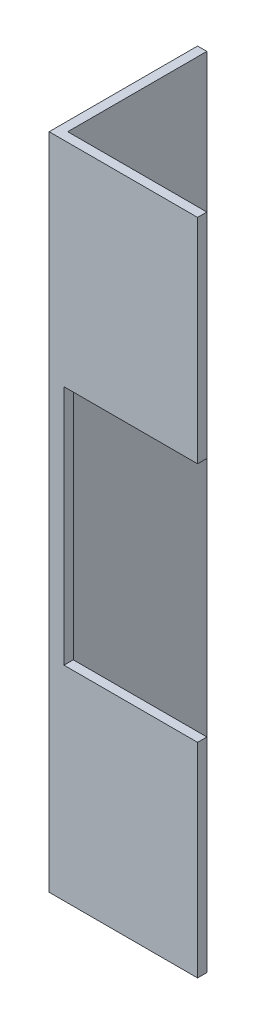
ISO-10303-21;
HEADER;
FILE_DESCRIPTION(('STEP AP214'),'2;1');
FILE_NAME('part.step','',(''),(''),'','','');
FILE_SCHEMA(('AUTOMOTIVE_DESIGN { 1 0 10303 214 1 1 1 1 }'));
ENDSEC;
DATA;
#1=APPLICATION_CONTEXT('core data for automotive mechanical design processes');
#2=APPLICATION_PROTOCOL_DEFINITION('international standard','automotive_design',2000,#1);
#3=PRODUCT_CONTEXT('',#1,'mechanical');
#4=PRODUCT('Part','Part','',(#3));
#5=PRODUCT_RELATED_PRODUCT_CATEGORY('part','',(#4));
#6=PRODUCT_DEFINITION_FORMATION('','',#4);
#7=PRODUCT_DEFINITION_CONTEXT('part definition',#1,'design');
#8=PRODUCT_DEFINITION('design','',#6,#7);
#9=PRODUCT_DEFINITION_SHAPE('','',#8);
#10=(LENGTH_UNIT() NAMED_UNIT(*) SI_UNIT(.MILLI.,.METRE.));
#11=(NAMED_UNIT(*) PLANE_ANGLE_UNIT() SI_UNIT($,.RADIAN.));
#12=(NAMED_UNIT(*) SI_UNIT($,.STERADIAN.) SOLID_ANGLE_UNIT());
#13=UNCERTAINTY_MEASURE_WITH_UNIT(LENGTH_MEASURE(1.E-05),#10,'distance_accuracy_value','');
#14=(GEOMETRIC_REPRESENTATION_CONTEXT(3) GLOBAL_UNCERTAINTY_ASSIGNED_CONTEXT((#13)) GLOBAL_UNIT_ASSIGNED_CONTEXT((#10,
#11,#12)) REPRESENTATION_CONTEXT('',''));
#15=CARTESIAN_POINT('',(0.,0.,0.));
#16=DIRECTION('',(0.,0.,1.));
#17=DIRECTION('',(1.,0.,0.));
#18=AXIS2_PLACEMENT_3D('',#15,#16,#17);
#19=CARTESIAN_POINT('',(25.4,112.7125,-1.5875));
#20=DIRECTION('',(-1.,0.,0.));
#21=DIRECTION('',(0.,0.,1.));
#22=AXIS2_PLACEMENT_3D('',#19,#20,#21);
#23=PLANE('',#22);
#24=DIRECTION('',(0.,-1.,0.));
#25=VECTOR('',#24,1.);
#26=CARTESIAN_POINT('',(25.4,112.7125,0.));
#27=LINE('',#26,#25);
#28=CARTESIAN_POINT('',(25.4,112.7125,0.));
#29=VERTEX_POINT('',#28);
#30=CARTESIAN_POINT('',(25.4,76.2,0.));
#31=VERTEX_POINT('',#30);
#32=EDGE_CURVE('E11',#29,#31,#27,.T.);
#33=ORIENTED_EDGE('',*,*,#32,.T.);
#34=DIRECTION('',(0.,0.,-1.));
#35=VECTOR('',#34,1.);
#36=CARTESIAN_POINT('',(25.4,76.2,0.));
#37=LINE('',#36,#35);
#38=CARTESIAN_POINT('',(25.4,76.2,-1.5875));
#39=VERTEX_POINT('',#38);
#40=EDGE_CURVE('E136',#31,#39,#37,.T.);
#41=ORIENTED_EDGE('',*,*,#40,.T.);
#42=DIRECTION('',(0.,-1.,0.));
#43=VECTOR('',#42,1.);
#44=CARTESIAN_POINT('',(25.4,112.7125,-1.5875));
#45=LINE('',#44,#43);
#46=CARTESIAN_POINT('',(25.4,112.7125,-1.5875));
#47=VERTEX_POINT('',#46);
#48=EDGE_CURVE('E149',#47,#39,#45,.T.);
#49=ORIENTED_EDGE('',*,*,#48,.F.);
#50=DIRECTION('',(0.,0.,-1.));
#51=VECTOR('',#50,1.);
#52=CARTESIAN_POINT('',(25.4,112.7125,-1.5875));
#53=LINE('',#52,#51);
#54=EDGE_CURVE('E94',#29,#47,#53,.T.);
#55=ORIENTED_EDGE('',*,*,#54,.F.);
#56=EDGE_LOOP('',(#33,#41,#49,#55));
#57=FACE_BOUND('',#56,.T.);
#58=ADVANCED_FACE('F35',(#57),#23,.F.);
#59=CARTESIAN_POINT('',(25.4,112.7125,0.));
#60=DIRECTION('',(0.,0.,-1.));
#61=DIRECTION('',(-1.,0.,0.));
#62=AXIS2_PLACEMENT_3D('',#59,#60,#61);
#63=PLANE('',#62);
#64=DIRECTION('',(0.,1.,0.));
#65=VECTOR('',#64,1.);
#66=CARTESIAN_POINT('',(2.54,34.925,0.));
#67=LINE('',#66,#65);
#68=CARTESIAN_POINT('',(2.54,34.925,0.));
#69=VERTEX_POINT('',#68);
#70=CARTESIAN_POINT('',(2.54,76.2,0.));
#71=VERTEX_POINT('',#70);
#72=EDGE_CURVE('E193',#69,#71,#67,.T.);
#73=ORIENTED_EDGE('',*,*,#72,.T.);
#74=DIRECTION('',(1.,0.,0.));
#75=VECTOR('',#74,1.);
#76=CARTESIAN_POINT('',(25.4,76.2,0.));
#77=LINE('',#76,#75);
#78=EDGE_CURVE('E176',#71,#31,#77,.T.);
#79=ORIENTED_EDGE('',*,*,#78,.T.);
#80=ORIENTED_EDGE('',*,*,#32,.F.);
#81=DIRECTION('',(1.,0.,0.));
#82=VECTOR('',#81,1.);
#83=CARTESIAN_POINT('',(25.4,112.7125,0.));
#84=LINE('',#83,#82);
#85=CARTESIAN_POINT('',(0.,112.7125,0.));
#86=VERTEX_POINT('',#85);
#87=EDGE_CURVE('E145',#86,#29,#84,.T.);
#88=ORIENTED_EDGE('',*,*,#87,.F.);
#89=DIRECTION('',(0.,-1.,0.));
#90=VECTOR('',#89,1.);
#91=CARTESIAN_POINT('',(0.,112.7125,0.));
#92=LINE('',#91,#90);
#93=CARTESIAN_POINT('',(0.,0.,0.));
#94=VERTEX_POINT('',#93);
#95=EDGE_CURVE('E128',#86,#94,#92,.T.);
#96=ORIENTED_EDGE('',*,*,#95,.T.);
#97=DIRECTION('',(1.,0.,0.));
#98=VECTOR('',#97,1.);
#99=CARTESIAN_POINT('',(25.4,0.,0.));
#100=LINE('',#99,#98);
#101=CARTESIAN_POINT('',(25.4,0.,0.));
#102=VERTEX_POINT('',#101);
#103=EDGE_CURVE('E132',#94,#102,#100,.T.);
#104=ORIENTED_EDGE('',*,*,#103,.T.);
#105=CARTESIAN_POINT('',(25.4,34.925,0.));
#106=VERTEX_POINT('',#105);
#107=EDGE_CURVE('E43',#106,#102,#27,.T.);
#108=ORIENTED_EDGE('',*,*,#107,.F.);
#109=DIRECTION('',(-1.,0.,0.));
#110=VECTOR('',#109,1.);
#111=CARTESIAN_POINT('',(25.4,34.925,0.));
#112=LINE('',#111,#110);
#113=EDGE_CURVE('E187',#106,#69,#112,.T.);
#114=ORIENTED_EDGE('',*,*,#113,.T.);
#115=EDGE_LOOP('',(#73,#79,#80,#88,#96,#104,#108,#114));
#116=FACE_BOUND('',#115,.T.);
#117=ADVANCED_FACE('F37',(#116),#63,.F.);
#118=CARTESIAN_POINT('',(25.4,34.925,-1.5875));
#119=VERTEX_POINT('',#118);
#120=CARTESIAN_POINT('',(25.4,0.,-1.5875));
#121=VERTEX_POINT('',#120);
#122=EDGE_CURVE('E148',#119,#121,#45,.T.);
#123=ORIENTED_EDGE('',*,*,#122,.F.);
#124=DIRECTION('',(0.,0.,-1.));
#125=VECTOR('',#124,1.);
#126=CARTESIAN_POINT('',(25.4,34.925,0.));
#127=LINE('',#126,#125);
#128=EDGE_CURVE('E50',#106,#119,#127,.T.);
#129=ORIENTED_EDGE('',*,*,#128,.F.);
#130=ORIENTED_EDGE('',*,*,#107,.T.);
#131=DIRECTION('',(0.,0.,-1.));
#132=VECTOR('',#131,1.);
#133=CARTESIAN_POINT('',(25.4,0.,-1.5875));
#134=LINE('',#133,#132);
#135=EDGE_CURVE('E135',#102,#121,#134,.T.);
#136=ORIENTED_EDGE('',*,*,#135,.T.);
#137=EDGE_LOOP('',(#123,#129,#130,#136));
#138=FACE_BOUND('',#137,.T.);
#139=ADVANCED_FACE('F160',(#138),#23,.F.);
#140=CARTESIAN_POINT('',(1.5875,112.7125,-1.5875));
#141=DIRECTION('',(0.,0.,1.));
#142=DIRECTION('',(1.,0.,0.));
#143=AXIS2_PLACEMENT_3D('',#140,#141,#142);
#144=PLANE('',#143);
#145=ORIENTED_EDGE('',*,*,#48,.T.);
#146=DIRECTION('',(1.,0.,0.));
#147=VECTOR('',#146,1.);
#148=CARTESIAN_POINT('',(25.4,76.2,-1.5875));
#149=LINE('',#148,#147);
#150=CARTESIAN_POINT('',(2.54,76.2,-1.5875));
#151=VERTEX_POINT('',#150);
#152=EDGE_CURVE('E184',#151,#39,#149,.T.);
#153=ORIENTED_EDGE('',*,*,#152,.F.);
#154=DIRECTION('',(0.,1.,0.));
#155=VECTOR('',#154,1.);
#156=CARTESIAN_POINT('',(2.54,34.925,-1.5875));
#157=LINE('',#156,#155);
#158=CARTESIAN_POINT('',(2.54,34.925,-1.5875));
#159=VERTEX_POINT('',#158);
#160=EDGE_CURVE('E188',#159,#151,#157,.T.);
#161=ORIENTED_EDGE('',*,*,#160,.F.);
#162=DIRECTION('',(-1.,0.,0.));
#163=VECTOR('',#162,1.);
#164=CARTESIAN_POINT('',(25.4,34.925,-1.5875));
#165=LINE('',#164,#163);
#166=EDGE_CURVE('E157',#119,#159,#165,.T.);
#167=ORIENTED_EDGE('',*,*,#166,.F.);
#168=ORIENTED_EDGE('',*,*,#122,.T.);
#169=DIRECTION('',(-1.,0.,0.));
#170=VECTOR('',#169,1.);
#171=CARTESIAN_POINT('',(1.5875,0.,-1.5875));
#172=LINE('',#171,#170);
#173=CARTESIAN_POINT('',(1.5875,0.,-1.5875));
#174=VERTEX_POINT('',#173);
#175=EDGE_CURVE('E139',#121,#174,#172,.T.);
#176=ORIENTED_EDGE('',*,*,#175,.T.);
#177=DIRECTION('',(0.,-1.,0.));
#178=VECTOR('',#177,1.);
#179=CARTESIAN_POINT('',(1.5875,112.7125,-1.5875));
#180=LINE('',#179,#178);
#181=CARTESIAN_POINT('',(1.5875,112.7125,-1.5875));
#182=VERTEX_POINT('',#181);
#183=EDGE_CURVE('E123',#182,#174,#180,.T.);
#184=ORIENTED_EDGE('',*,*,#183,.F.);
#185=DIRECTION('',(-1.,0.,0.));
#186=VECTOR('',#185,1.);
#187=CARTESIAN_POINT('',(1.5875,112.7125,-1.5875));
#188=LINE('',#187,#186);
#189=EDGE_CURVE('E111',#47,#182,#188,.T.);
#190=ORIENTED_EDGE('',*,*,#189,.F.);
#191=EDGE_LOOP('',(#145,#153,#161,#167,#168,#176,#184,#190));
#192=FACE_BOUND('',#191,.T.);
#193=ADVANCED_FACE('F154',(#192),#144,.F.);
#194=CARTESIAN_POINT('',(1.5875,112.7125,-25.4));
#195=DIRECTION('',(-1.,0.,0.));
#196=DIRECTION('',(0.,0.,1.));
#197=AXIS2_PLACEMENT_3D('',#194,#195,#196);
#198=PLANE('',#197);
#199=DIRECTION('',(0.,0.,-1.));
#200=VECTOR('',#199,1.);
#201=CARTESIAN_POINT('',(1.5875,0.,-25.4));
#202=LINE('',#201,#200);
#203=CARTESIAN_POINT('',(1.5875,0.,-25.4));
#204=VERTEX_POINT('',#203);
#205=EDGE_CURVE('E120',#174,#204,#202,.T.);
#206=ORIENTED_EDGE('',*,*,#205,.T.);
#207=DIRECTION('',(0.,-1.,0.));
#208=VECTOR('',#207,1.);
#209=CARTESIAN_POINT('',(1.5875,112.7125,-25.4));
#210=LINE('',#209,#208);
#211=CARTESIAN_POINT('',(1.5875,112.7125,-25.4));
#212=VERTEX_POINT('',#211);
#213=EDGE_CURVE('E117',#212,#204,#210,.T.);
#214=ORIENTED_EDGE('',*,*,#213,.F.);
#215=DIRECTION('',(0.,0.,-1.));
#216=VECTOR('',#215,1.);
#217=CARTESIAN_POINT('',(1.5875,112.7125,-25.4));
#218=LINE('',#217,#216);
#219=EDGE_CURVE('E104',#182,#212,#218,.T.);
#220=ORIENTED_EDGE('',*,*,#219,.F.);
#221=ORIENTED_EDGE('',*,*,#183,.T.);
#222=EDGE_LOOP('',(#206,#214,#220,#221));
#223=FACE_BOUND('',#222,.T.);
#224=ADVANCED_FACE('F118',(#223),#198,.F.);
#225=CARTESIAN_POINT('',(0.,112.7125,-25.4));
#226=DIRECTION('',(0.,0.,1.));
#227=DIRECTION('',(1.,0.,0.));
#228=AXIS2_PLACEMENT_3D('',#225,#226,#227);
#229=PLANE('',#228);
#230=DIRECTION('',(-1.,0.,0.));
#231=VECTOR('',#230,1.);
#232=CARTESIAN_POINT('',(0.,0.,-25.4));
#233=LINE('',#232,#231);
#234=CARTESIAN_POINT('',(0.,0.,-25.4));
#235=VERTEX_POINT('',#234);
#236=EDGE_CURVE('E142',#204,#235,#233,.T.);
#237=ORIENTED_EDGE('',*,*,#236,.T.);
#238=DIRECTION('',(0.,-1.,0.));
#239=VECTOR('',#238,1.);
#240=CARTESIAN_POINT('',(0.,112.7125,-25.4));
#241=LINE('',#240,#239);
#242=CARTESIAN_POINT('',(0.,112.7125,-25.4));
#243=VERTEX_POINT('',#242);
#244=EDGE_CURVE('E124',#243,#235,#241,.T.);
#245=ORIENTED_EDGE('',*,*,#244,.F.);
#246=DIRECTION('',(-1.,0.,0.));
#247=VECTOR('',#246,1.);
#248=CARTESIAN_POINT('',(0.,112.7125,-25.4));
#249=LINE('',#248,#247);
#250=EDGE_CURVE('E108',#212,#243,#249,.T.);
#251=ORIENTED_EDGE('',*,*,#250,.F.);
#252=ORIENTED_EDGE('',*,*,#213,.T.);
#253=EDGE_LOOP('',(#237,#245,#251,#252));
#254=FACE_BOUND('',#253,.T.);
#255=ADVANCED_FACE('F126',(#254),#229,.F.);
#256=CARTESIAN_POINT('',(0.,112.7125,0.));
#257=DIRECTION('',(1.,0.,0.));
#258=DIRECTION('',(0.,0.,-1.));
#259=AXIS2_PLACEMENT_3D('',#256,#257,#258);
#260=PLANE('',#259);
#261=DIRECTION('',(0.,0.,1.));
#262=VECTOR('',#261,1.);
#263=CARTESIAN_POINT('',(0.,0.,0.));
#264=LINE('',#263,#262);
#265=EDGE_CURVE('E86',#235,#94,#264,.T.);
#266=ORIENTED_EDGE('',*,*,#265,.T.);
#267=ORIENTED_EDGE('',*,*,#95,.F.);
#268=DIRECTION('',(0.,0.,1.));
#269=VECTOR('',#268,1.);
#270=CARTESIAN_POINT('',(0.,112.7125,0.));
#271=LINE('',#270,#269);
#272=EDGE_CURVE('E59',#243,#86,#271,.T.);
#273=ORIENTED_EDGE('',*,*,#272,.F.);
#274=ORIENTED_EDGE('',*,*,#244,.T.);
#275=EDGE_LOOP('',(#266,#267,#273,#274));
#276=FACE_BOUND('',#275,.T.);
#277=ADVANCED_FACE('F165',(#276),#260,.F.);
#278=CARTESIAN_POINT('',(0.,112.7125,0.));
#279=DIRECTION('',(0.,-1.,0.));
#280=DIRECTION('',(0.,0.,-1.));
#281=AXIS2_PLACEMENT_3D('',#278,#279,#280);
#282=PLANE('',#281);
#283=ORIENTED_EDGE('',*,*,#87,.T.);
#284=ORIENTED_EDGE('',*,*,#54,.T.);
#285=ORIENTED_EDGE('',*,*,#189,.T.);
#286=ORIENTED_EDGE('',*,*,#219,.T.);
#287=ORIENTED_EDGE('',*,*,#250,.T.);
#288=ORIENTED_EDGE('',*,*,#272,.T.);
#289=EDGE_LOOP('',(#283,#284,#285,#286,#287,#288));
#290=FACE_BOUND('',#289,.T.);
#291=ADVANCED_FACE('F106',(#290),#282,.F.);
#292=CARTESIAN_POINT('',(0.,0.,0.));
#293=DIRECTION('',(0.,-1.,0.));
#294=DIRECTION('',(0.,0.,-1.));
#295=AXIS2_PLACEMENT_3D('',#292,#293,#294);
#296=PLANE('',#295);
#297=ORIENTED_EDGE('',*,*,#103,.F.);
#298=ORIENTED_EDGE('',*,*,#265,.F.);
#299=ORIENTED_EDGE('',*,*,#236,.F.);
#300=ORIENTED_EDGE('',*,*,#205,.F.);
#301=ORIENTED_EDGE('',*,*,#175,.F.);
#302=ORIENTED_EDGE('',*,*,#135,.F.);
#303=EDGE_LOOP('',(#297,#298,#299,#300,#301,#302));
#304=FACE_BOUND('',#303,.T.);
#305=ADVANCED_FACE('F164',(#304),#296,.T.);
#306=CARTESIAN_POINT('',(25.4,76.2,0.));
#307=DIRECTION('',(0.,1.,0.));
#308=DIRECTION('',(0.,0.,1.));
#309=AXIS2_PLACEMENT_3D('',#306,#307,#308);
#310=PLANE('',#309);
#311=ORIENTED_EDGE('',*,*,#152,.T.);
#312=ORIENTED_EDGE('',*,*,#40,.F.);
#313=ORIENTED_EDGE('',*,*,#78,.F.);
#314=DIRECTION('',(0.,0.,-1.));
#315=VECTOR('',#314,1.);
#316=CARTESIAN_POINT('',(2.54,76.2,0.));
#317=LINE('',#316,#315);
#318=EDGE_CURVE('E179',#71,#151,#317,.T.);
#319=ORIENTED_EDGE('',*,*,#318,.T.);
#320=EDGE_LOOP('',(#311,#312,#313,#319));
#321=FACE_BOUND('',#320,.T.);
#322=ADVANCED_FACE('F213',(#321),#310,.F.);
#323=CARTESIAN_POINT('',(2.54,34.925,0.));
#324=DIRECTION('',(-1.,0.,0.));
#325=DIRECTION('',(0.,0.,1.));
#326=AXIS2_PLACEMENT_3D('',#323,#324,#325);
#327=PLANE('',#326);
#328=ORIENTED_EDGE('',*,*,#160,.T.);
#329=ORIENTED_EDGE('',*,*,#318,.F.);
#330=ORIENTED_EDGE('',*,*,#72,.F.);
#331=DIRECTION('',(0.,0.,-1.));
#332=VECTOR('',#331,1.);
#333=CARTESIAN_POINT('',(2.54,34.925,0.));
#334=LINE('',#333,#332);
#335=EDGE_CURVE('E175',#69,#159,#334,.T.);
#336=ORIENTED_EDGE('',*,*,#335,.T.);
#337=EDGE_LOOP('',(#328,#329,#330,#336));
#338=FACE_BOUND('',#337,.T.);
#339=ADVANCED_FACE('F215',(#338),#327,.F.);
#340=CARTESIAN_POINT('',(25.4,34.925,0.));
#341=DIRECTION('',(0.,-1.,0.));
#342=DIRECTION('',(0.,0.,-1.));
#343=AXIS2_PLACEMENT_3D('',#340,#341,#342);
#344=PLANE('',#343);
#345=ORIENTED_EDGE('',*,*,#166,.T.);
#346=ORIENTED_EDGE('',*,*,#335,.F.);
#347=ORIENTED_EDGE('',*,*,#113,.F.);
#348=ORIENTED_EDGE('',*,*,#128,.T.);
#349=EDGE_LOOP('',(#345,#346,#347,#348));
#350=FACE_BOUND('',#349,.T.);
#351=ADVANCED_FACE('F202',(#350),#344,.F.);
#352=CLOSED_SHELL('',(#58,#117,#139,#193,#224,#255,#277,#291,#305,#322,#339,#351));
#353=MANIFOLD_SOLID_BREP('B2',#352);
#354=ADVANCED_BREP_SHAPE_REPRESENTATION('',(#18,#353),#14);
#355=SHAPE_DEFINITION_REPRESENTATION(#9,#354);
ENDSEC;
END-ISO-10303-21;
